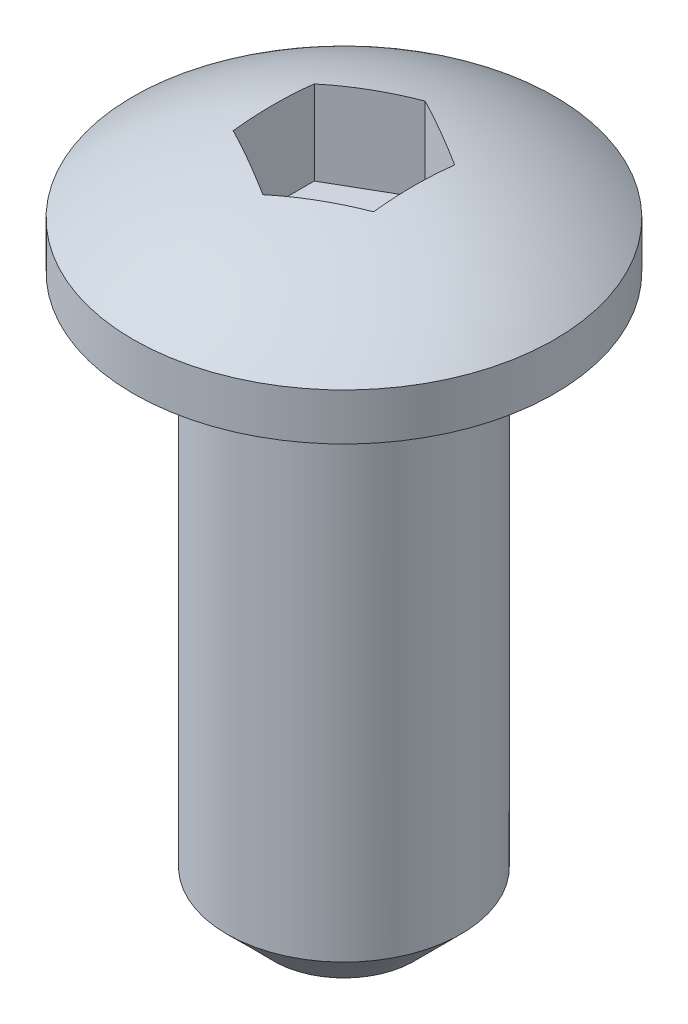
ISO-10303-21;
HEADER;
FILE_DESCRIPTION(('STEP AP214'),'2;1');
FILE_NAME('part.step','',(''),(''),'','','');
FILE_SCHEMA(('AUTOMOTIVE_DESIGN { 1 0 10303 214 1 1 1 1 }'));
ENDSEC;
DATA;
#1=APPLICATION_CONTEXT('core data for automotive mechanical design processes');
#2=APPLICATION_PROTOCOL_DEFINITION('international standard','automotive_design',2000,#1);
#3=PRODUCT_CONTEXT('',#1,'mechanical');
#4=PRODUCT('Part','Part','',(#3));
#5=PRODUCT_RELATED_PRODUCT_CATEGORY('part','',(#4));
#6=PRODUCT_DEFINITION_FORMATION('','',#4);
#7=PRODUCT_DEFINITION_CONTEXT('part definition',#1,'design');
#8=PRODUCT_DEFINITION('design','',#6,#7);
#9=PRODUCT_DEFINITION_SHAPE('','',#8);
#10=(LENGTH_UNIT() NAMED_UNIT(*) SI_UNIT(.MILLI.,.METRE.));
#11=(NAMED_UNIT(*) PLANE_ANGLE_UNIT() SI_UNIT($,.RADIAN.));
#12=(NAMED_UNIT(*) SI_UNIT($,.STERADIAN.) SOLID_ANGLE_UNIT());
#13=UNCERTAINTY_MEASURE_WITH_UNIT(LENGTH_MEASURE(1.E-05),#10,'distance_accuracy_value','');
#14=(GEOMETRIC_REPRESENTATION_CONTEXT(3) GLOBAL_UNCERTAINTY_ASSIGNED_CONTEXT((#13)) GLOBAL_UNIT_ASSIGNED_CONTEXT((#10,
#11,#12)) REPRESENTATION_CONTEXT('',''));
#15=CARTESIAN_POINT('',(0.,0.,0.));
#16=DIRECTION('',(0.,0.,1.));
#17=DIRECTION('',(1.,0.,0.));
#18=AXIS2_PLACEMENT_3D('',#15,#16,#17);
#19=CARTESIAN_POINT('',(0.,-5.,0.));
#20=DIRECTION('',(0.,1.,0.));
#21=DIRECTION('',(-1.,0.,0.));
#22=AXIS2_PLACEMENT_3D('',#19,#20,#21);
#23=SPHERICAL_SURFACE('',#22,7.5);
#24=CARTESIAN_POINT('',(0.,1.,0.));
#25=DIRECTION('',(0.,1.,0.));
#26=DIRECTION('',(0.,0.,1.));
#27=AXIS2_PLACEMENT_3D('',#24,#25,#26);
#28=CIRCLE('',#27,4.5);
#29=CARTESIAN_POINT('',(0.,1.,4.5));
#30=VERTEX_POINT('',#29);
#31=EDGE_CURVE('E128',#30,#30,#28,.T.);
#32=ORIENTED_EDGE('',*,*,#31,.T.);
#33=EDGE_LOOP('',(#32));
#34=FACE_BOUND('',#33,.T.);
#35=CARTESIAN_POINT('',(-0.749999999999999,-5.,-1.29903810567666));
#36=DIRECTION('',(0.5,0.,0.866025403784439));
#37=DIRECTION('',(0.866025403784439,0.,-0.5));
#38=AXIS2_PLACEMENT_3D('',#35,#36,#37);
#39=CIRCLE('',#38,7.34846922834954);
#40=CARTESIAN_POINT('',(-1.5,2.29725975966321,-0.866025403784439));
#41=VERTEX_POINT('',#40);
#42=CARTESIAN_POINT('',(0.,2.29725975966321,-1.73205080756888));
#43=VERTEX_POINT('',#42);
#44=EDGE_CURVE('E143',#41,#43,#39,.F.);
#45=ORIENTED_EDGE('',*,*,#44,.T.);
#46=CARTESIAN_POINT('',(0.750000000000002,-5.,-1.29903810567666));
#47=DIRECTION('',(-0.5,0.,0.866025403784438));
#48=DIRECTION('',(0.866025403784439,0.,0.5));
#49=AXIS2_PLACEMENT_3D('',#46,#47,#48);
#50=CIRCLE('',#49,7.34846922834954);
#51=CARTESIAN_POINT('',(1.5,2.29725975966321,-0.866025403784439));
#52=VERTEX_POINT('',#51);
#53=EDGE_CURVE('E54',#43,#52,#50,.F.);
#54=ORIENTED_EDGE('',*,*,#53,.T.);
#55=CARTESIAN_POINT('',(1.5,-5.,0.));
#56=DIRECTION('',(-1.,0.,0.));
#57=DIRECTION('',(0.,0.,1.));
#58=AXIS2_PLACEMENT_3D('',#55,#56,#57);
#59=CIRCLE('',#58,7.34846922834954);
#60=CARTESIAN_POINT('',(1.5,2.29725975966321,0.86602540378444));
#61=VERTEX_POINT('',#60);
#62=EDGE_CURVE('E131',#52,#61,#59,.F.);
#63=ORIENTED_EDGE('',*,*,#62,.T.);
#64=CARTESIAN_POINT('',(0.750000000000002,-5.,1.29903810567666));
#65=DIRECTION('',(-0.5,0.,-0.866025403784439));
#66=DIRECTION('',(-0.866025403784439,0.,0.5));
#67=AXIS2_PLACEMENT_3D('',#64,#65,#66);
#68=CIRCLE('',#67,7.34846922834954);
#69=CARTESIAN_POINT('',(0.,2.29725975966321,1.73205080756888));
#70=VERTEX_POINT('',#69);
#71=EDGE_CURVE('E134',#61,#70,#68,.F.);
#72=ORIENTED_EDGE('',*,*,#71,.T.);
#73=CARTESIAN_POINT('',(-0.749999999999998,-5.,1.29903810567666));
#74=DIRECTION('',(0.5,0.,-0.866025403784439));
#75=DIRECTION('',(-0.866025403784439,0.,-0.5));
#76=AXIS2_PLACEMENT_3D('',#73,#74,#75);
#77=CIRCLE('',#76,7.34846922834954);
#78=CARTESIAN_POINT('',(-1.5,2.29725975966321,0.866025403784438));
#79=VERTEX_POINT('',#78);
#80=EDGE_CURVE('E137',#70,#79,#77,.F.);
#81=ORIENTED_EDGE('',*,*,#80,.T.);
#82=CARTESIAN_POINT('',(-1.5,-5.,0.));
#83=DIRECTION('',(1.,0.,0.));
#84=DIRECTION('',(0.,0.,-1.));
#85=AXIS2_PLACEMENT_3D('',#82,#83,#84);
#86=CIRCLE('',#85,7.34846922834954);
#87=EDGE_CURVE('E140',#79,#41,#86,.F.);
#88=ORIENTED_EDGE('',*,*,#87,.T.);
#89=EDGE_LOOP('',(#45,#54,#63,#72,#81,#88));
#90=FACE_BOUND('',#89,.T.);
#91=ADVANCED_FACE('F31',(#34,#90),#23,.T.);
#92=CARTESIAN_POINT('',(0.,-12.,0.));
#93=DIRECTION('',(0.,-1.,0.));
#94=DIRECTION('',(0.,0.,-1.));
#95=AXIS2_PLACEMENT_3D('',#92,#93,#94);
#96=PLANE('',#95);
#97=CARTESIAN_POINT('',(0.,-12.,0.));
#98=DIRECTION('',(0.,-1.,0.));
#99=DIRECTION('',(0.,0.,-1.));
#100=AXIS2_PLACEMENT_3D('',#97,#98,#99);
#101=CIRCLE('',#100,1.49999999999999);
#102=CARTESIAN_POINT('',(0.,-12.,-1.49999999999999));
#103=VERTEX_POINT('',#102);
#104=EDGE_CURVE('E11',#103,#103,#101,.T.);
#105=ORIENTED_EDGE('',*,*,#104,.T.);
#106=EDGE_LOOP('',(#105));
#107=FACE_BOUND('',#106,.T.);
#108=ADVANCED_FACE('F33',(#107),#96,.T.);
#109=CARTESIAN_POINT('',(0.,16.1829805996473,0.));
#110=DIRECTION('',(0.,1.,0.));
#111=DIRECTION('',(0.,0.,1.));
#112=AXIS2_PLACEMENT_3D('',#109,#110,#111);
#113=CYLINDRICAL_SURFACE('',#112,4.5);
#114=CARTESIAN_POINT('',(0.,0.,0.));
#115=DIRECTION('',(0.,1.,0.));
#116=DIRECTION('',(0.,0.,1.));
#117=AXIS2_PLACEMENT_3D('',#114,#115,#116);
#118=CIRCLE('',#117,4.5);
#119=CARTESIAN_POINT('',(0.,0.,4.5));
#120=VERTEX_POINT('',#119);
#121=EDGE_CURVE('E125',#120,#120,#118,.T.);
#122=ORIENTED_EDGE('',*,*,#121,.T.);
#123=EDGE_LOOP('',(#122));
#124=FACE_BOUND('',#123,.T.);
#125=ORIENTED_EDGE('',*,*,#31,.F.);
#126=EDGE_LOOP('',(#125));
#127=FACE_BOUND('',#126,.T.);
#128=ADVANCED_FACE('F169',(#124,#127),#113,.T.);
#129=CARTESIAN_POINT('',(-2.5,0.,0.));
#130=DIRECTION('',(0.,-1.,0.));
#131=DIRECTION('',(0.,0.,-1.));
#132=AXIS2_PLACEMENT_3D('',#129,#130,#131);
#133=PLANE('',#132);
#134=CARTESIAN_POINT('',(0.,0.,0.));
#135=DIRECTION('',(0.,1.,0.));
#136=DIRECTION('',(0.,0.,1.));
#137=AXIS2_PLACEMENT_3D('',#134,#135,#136);
#138=CIRCLE('',#137,2.5);
#139=CARTESIAN_POINT('',(0.,0.,2.5));
#140=VERTEX_POINT('',#139);
#141=EDGE_CURVE('E90',#140,#140,#138,.T.);
#142=ORIENTED_EDGE('',*,*,#141,.T.);
#143=EDGE_LOOP('',(#142));
#144=FACE_BOUND('',#143,.T.);
#145=ORIENTED_EDGE('',*,*,#121,.F.);
#146=EDGE_LOOP('',(#145));
#147=FACE_BOUND('',#146,.T.);
#148=ADVANCED_FACE('F175',(#144,#147),#133,.T.);
#149=CARTESIAN_POINT('',(0.,16.1829805996473,0.));
#150=DIRECTION('',(0.,1.,0.));
#151=DIRECTION('',(0.,0.,1.));
#152=AXIS2_PLACEMENT_3D('',#149,#150,#151);
#153=CYLINDRICAL_SURFACE('',#152,2.5);
#154=CARTESIAN_POINT('',(0.,-11.,0.));
#155=DIRECTION('',(0.,-1.,0.));
#156=DIRECTION('',(0.,0.,-1.));
#157=AXIS2_PLACEMENT_3D('',#154,#155,#156);
#158=CIRCLE('',#157,2.5);
#159=CARTESIAN_POINT('',(0.,-11.,-2.5));
#160=VERTEX_POINT('',#159);
#161=EDGE_CURVE('E39',#160,#160,#158,.F.);
#162=ORIENTED_EDGE('',*,*,#161,.T.);
#163=EDGE_LOOP('',(#162));
#164=FACE_BOUND('',#163,.T.);
#165=ORIENTED_EDGE('',*,*,#141,.F.);
#166=EDGE_LOOP('',(#165));
#167=FACE_BOUND('',#166,.T.);
#168=ADVANCED_FACE('F148',(#164,#167),#153,.T.);
#169=CARTESIAN_POINT('',(1.5,2.5,-0.866025403784439));
#170=DIRECTION('',(-0.5,0.,0.866025403784438));
#171=DIRECTION('',(0.866025403784439,0.,0.5));
#172=AXIS2_PLACEMENT_3D('',#169,#170,#171);
#173=PLANE('',#172);
#174=DIRECTION('',(0.,-1.,0.));
#175=VECTOR('',#174,1.);
#176=CARTESIAN_POINT('',(0.,2.5,-1.73205080756888));
#177=LINE('',#176,#175);
#178=CARTESIAN_POINT('',(0.,0.5,-1.73205080756888));
#179=VERTEX_POINT('',#178);
#180=EDGE_CURVE('E83',#43,#179,#177,.T.);
#181=ORIENTED_EDGE('',*,*,#180,.T.);
#182=DIRECTION('',(-0.866025403784439,0.,-0.5));
#183=VECTOR('',#182,1.);
#184=CARTESIAN_POINT('',(1.5,0.5,-0.866025403784439));
#185=LINE('',#184,#183);
#186=CARTESIAN_POINT('',(1.5,0.5,-0.866025403784439));
#187=VERTEX_POINT('',#186);
#188=EDGE_CURVE('E87',#187,#179,#185,.T.);
#189=ORIENTED_EDGE('',*,*,#188,.F.);
#190=DIRECTION('',(0.,-1.,0.));
#191=VECTOR('',#190,1.);
#192=CARTESIAN_POINT('',(1.5,2.5,-0.866025403784439));
#193=LINE('',#192,#191);
#194=EDGE_CURVE('E115',#52,#187,#193,.T.);
#195=ORIENTED_EDGE('',*,*,#194,.F.);
#196=ORIENTED_EDGE('',*,*,#53,.F.);
#197=EDGE_LOOP('',(#181,#189,#195,#196));
#198=FACE_BOUND('',#197,.T.);
#199=ADVANCED_FACE('F85',(#198),#173,.T.);
#200=CARTESIAN_POINT('',(0.,2.5,-1.73205080756888));
#201=DIRECTION('',(0.5,0.,0.866025403784439));
#202=DIRECTION('',(0.866025403784439,0.,-0.5));
#203=AXIS2_PLACEMENT_3D('',#200,#201,#202);
#204=PLANE('',#203);
#205=DIRECTION('',(0.,-1.,0.));
#206=VECTOR('',#205,1.);
#207=CARTESIAN_POINT('',(-1.5,2.5,-0.866025403784439));
#208=LINE('',#207,#206);
#209=CARTESIAN_POINT('',(-1.5,0.5,-0.866025403784439));
#210=VERTEX_POINT('',#209);
#211=EDGE_CURVE('E91',#41,#210,#208,.T.);
#212=ORIENTED_EDGE('',*,*,#211,.T.);
#213=DIRECTION('',(-0.866025403784439,0.,0.5));
#214=VECTOR('',#213,1.);
#215=CARTESIAN_POINT('',(0.,0.5,-1.73205080756888));
#216=LINE('',#215,#214);
#217=EDGE_CURVE('E94',#179,#210,#216,.T.);
#218=ORIENTED_EDGE('',*,*,#217,.F.);
#219=ORIENTED_EDGE('',*,*,#180,.F.);
#220=ORIENTED_EDGE('',*,*,#44,.F.);
#221=EDGE_LOOP('',(#212,#218,#219,#220));
#222=FACE_BOUND('',#221,.T.);
#223=ADVANCED_FACE('F95',(#222),#204,.T.);
#224=CARTESIAN_POINT('',(-1.5,2.5,-0.866025403784439));
#225=DIRECTION('',(1.,0.,0.));
#226=DIRECTION('',(0.,0.,-1.));
#227=AXIS2_PLACEMENT_3D('',#224,#225,#226);
#228=PLANE('',#227);
#229=DIRECTION('',(0.,-1.,0.));
#230=VECTOR('',#229,1.);
#231=CARTESIAN_POINT('',(-1.5,2.5,0.866025403784438));
#232=LINE('',#231,#230);
#233=CARTESIAN_POINT('',(-1.5,0.5,0.866025403784438));
#234=VERTEX_POINT('',#233);
#235=EDGE_CURVE('E120',#79,#234,#232,.T.);
#236=ORIENTED_EDGE('',*,*,#235,.T.);
#237=DIRECTION('',(0.,0.,1.));
#238=VECTOR('',#237,1.);
#239=CARTESIAN_POINT('',(-1.5,0.5,-0.866025403784439));
#240=LINE('',#239,#238);
#241=EDGE_CURVE('E100',#210,#234,#240,.T.);
#242=ORIENTED_EDGE('',*,*,#241,.F.);
#243=ORIENTED_EDGE('',*,*,#211,.F.);
#244=ORIENTED_EDGE('',*,*,#87,.F.);
#245=EDGE_LOOP('',(#236,#242,#243,#244));
#246=FACE_BOUND('',#245,.T.);
#247=ADVANCED_FACE('F183',(#246),#228,.T.);
#248=CARTESIAN_POINT('',(-1.5,2.5,0.866025403784438));
#249=DIRECTION('',(0.5,0.,-0.866025403784439));
#250=DIRECTION('',(-0.866025403784439,0.,-0.5));
#251=AXIS2_PLACEMENT_3D('',#248,#249,#250);
#252=PLANE('',#251);
#253=DIRECTION('',(0.,-1.,0.));
#254=VECTOR('',#253,1.);
#255=CARTESIAN_POINT('',(0.,2.5,1.73205080756888));
#256=LINE('',#255,#254);
#257=CARTESIAN_POINT('',(0.,0.5,1.73205080756888));
#258=VERTEX_POINT('',#257);
#259=EDGE_CURVE('E118',#70,#258,#256,.T.);
#260=ORIENTED_EDGE('',*,*,#259,.T.);
#261=DIRECTION('',(0.866025403784439,0.,0.5));
#262=VECTOR('',#261,1.);
#263=CARTESIAN_POINT('',(-1.5,0.5,0.866025403784438));
#264=LINE('',#263,#262);
#265=EDGE_CURVE('E109',#234,#258,#264,.T.);
#266=ORIENTED_EDGE('',*,*,#265,.F.);
#267=ORIENTED_EDGE('',*,*,#235,.F.);
#268=ORIENTED_EDGE('',*,*,#80,.F.);
#269=EDGE_LOOP('',(#260,#266,#267,#268));
#270=FACE_BOUND('',#269,.T.);
#271=ADVANCED_FACE('F186',(#270),#252,.T.);
#272=CARTESIAN_POINT('',(0.,2.5,1.73205080756888));
#273=DIRECTION('',(-0.5,0.,-0.866025403784439));
#274=DIRECTION('',(-0.866025403784439,0.,0.5));
#275=AXIS2_PLACEMENT_3D('',#272,#273,#274);
#276=PLANE('',#275);
#277=DIRECTION('',(0.,-1.,0.));
#278=VECTOR('',#277,1.);
#279=CARTESIAN_POINT('',(1.5,2.5,0.86602540378444));
#280=LINE('',#279,#278);
#281=CARTESIAN_POINT('',(1.5,0.5,0.86602540378444));
#282=VERTEX_POINT('',#281);
#283=EDGE_CURVE('E46',#61,#282,#280,.T.);
#284=ORIENTED_EDGE('',*,*,#283,.T.);
#285=DIRECTION('',(0.866025403784439,0.,-0.5));
#286=VECTOR('',#285,1.);
#287=CARTESIAN_POINT('',(0.,0.5,1.73205080756888));
#288=LINE('',#287,#286);
#289=EDGE_CURVE('E112',#258,#282,#288,.T.);
#290=ORIENTED_EDGE('',*,*,#289,.F.);
#291=ORIENTED_EDGE('',*,*,#259,.F.);
#292=ORIENTED_EDGE('',*,*,#71,.F.);
#293=EDGE_LOOP('',(#284,#290,#291,#292));
#294=FACE_BOUND('',#293,.T.);
#295=ADVANCED_FACE('F190',(#294),#276,.T.);
#296=CARTESIAN_POINT('',(1.5,2.5,0.86602540378444));
#297=DIRECTION('',(-1.,0.,0.));
#298=DIRECTION('',(0.,0.,1.));
#299=AXIS2_PLACEMENT_3D('',#296,#297,#298);
#300=PLANE('',#299);
#301=ORIENTED_EDGE('',*,*,#194,.T.);
#302=DIRECTION('',(0.,0.,-1.));
#303=VECTOR('',#302,1.);
#304=CARTESIAN_POINT('',(1.5,0.5,0.86602540378444));
#305=LINE('',#304,#303);
#306=EDGE_CURVE('E105',#282,#187,#305,.T.);
#307=ORIENTED_EDGE('',*,*,#306,.F.);
#308=ORIENTED_EDGE('',*,*,#283,.F.);
#309=ORIENTED_EDGE('',*,*,#62,.F.);
#310=EDGE_LOOP('',(#301,#307,#308,#309));
#311=FACE_BOUND('',#310,.T.);
#312=ADVANCED_FACE('F159',(#311),#300,.T.);
#313=CARTESIAN_POINT('',(3.,0.5,0.));
#314=DIRECTION('',(0.,-1.,0.));
#315=DIRECTION('',(0.,0.,-1.));
#316=AXIS2_PLACEMENT_3D('',#313,#314,#315);
#317=PLANE('',#316);
#318=ORIENTED_EDGE('',*,*,#188,.T.);
#319=ORIENTED_EDGE('',*,*,#217,.T.);
#320=ORIENTED_EDGE('',*,*,#241,.T.);
#321=ORIENTED_EDGE('',*,*,#265,.T.);
#322=ORIENTED_EDGE('',*,*,#289,.T.);
#323=ORIENTED_EDGE('',*,*,#306,.T.);
#324=EDGE_LOOP('',(#318,#319,#320,#321,#322,#323));
#325=FACE_BOUND('',#324,.T.);
#326=ADVANCED_FACE('F103',(#325),#317,.F.);
#327=CARTESIAN_POINT('',(0.,-11.,0.));
#328=DIRECTION('',(0.,1.,0.));
#329=DIRECTION('',(0.,0.,1.));
#330=AXIS2_PLACEMENT_3D('',#327,#328,#329);
#331=CONICAL_SURFACE('',#330,2.5,0.785398163397451);
#332=ORIENTED_EDGE('',*,*,#104,.F.);
#333=EDGE_LOOP('',(#332));
#334=FACE_BOUND('',#333,.T.);
#335=ORIENTED_EDGE('',*,*,#161,.F.);
#336=EDGE_LOOP('',(#335));
#337=FACE_BOUND('',#336,.T.);
#338=ADVANCED_FACE('F151',(#334,#337),#331,.T.);
#339=CLOSED_SHELL('',(#91,#108,#128,#148,#168,#199,#223,#247,#271,#295,#312,#326,#338));
#340=MANIFOLD_SOLID_BREP('B2',#339);
#341=ADVANCED_BREP_SHAPE_REPRESENTATION('',(#18,#340),#14);
#342=SHAPE_DEFINITION_REPRESENTATION(#9,#341);
ENDSEC;
END-ISO-10303-21;
